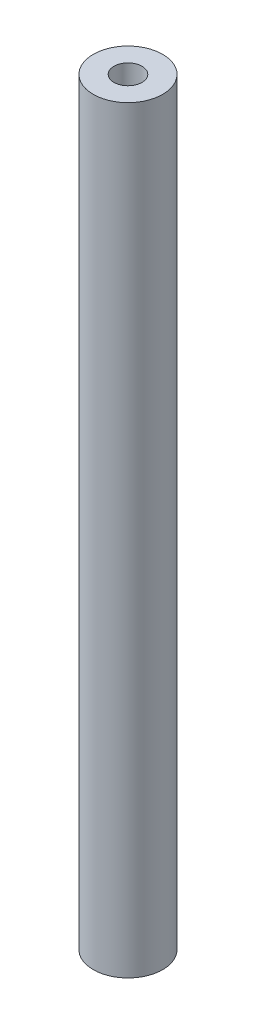
ISO-10303-21;
HEADER;
FILE_DESCRIPTION(('STEP AP214'),'2;1');
FILE_NAME('part.step','',(''),(''),'','','');
FILE_SCHEMA(('AUTOMOTIVE_DESIGN { 1 0 10303 214 1 1 1 1 }'));
ENDSEC;
DATA;
#1=APPLICATION_CONTEXT('core data for automotive mechanical design processes');
#2=APPLICATION_PROTOCOL_DEFINITION('international standard','automotive_design',2000,#1);
#3=PRODUCT_CONTEXT('',#1,'mechanical');
#4=PRODUCT('Part','Part','',(#3));
#5=PRODUCT_RELATED_PRODUCT_CATEGORY('part','',(#4));
#6=PRODUCT_DEFINITION_FORMATION('','',#4);
#7=PRODUCT_DEFINITION_CONTEXT('part definition',#1,'design');
#8=PRODUCT_DEFINITION('design','',#6,#7);
#9=PRODUCT_DEFINITION_SHAPE('','',#8);
#10=(LENGTH_UNIT() NAMED_UNIT(*) SI_UNIT(.MILLI.,.METRE.));
#11=(NAMED_UNIT(*) PLANE_ANGLE_UNIT() SI_UNIT($,.RADIAN.));
#12=(NAMED_UNIT(*) SI_UNIT($,.STERADIAN.) SOLID_ANGLE_UNIT());
#13=UNCERTAINTY_MEASURE_WITH_UNIT(LENGTH_MEASURE(1.E-05),#10,'distance_accuracy_value','');
#14=(GEOMETRIC_REPRESENTATION_CONTEXT(3) GLOBAL_UNCERTAINTY_ASSIGNED_CONTEXT((#13)) GLOBAL_UNIT_ASSIGNED_CONTEXT((#10,
#11,#12)) REPRESENTATION_CONTEXT('',''));
#15=CARTESIAN_POINT('',(0.,0.,0.));
#16=DIRECTION('',(0.,0.,1.));
#17=DIRECTION('',(1.,0.,0.));
#18=AXIS2_PLACEMENT_3D('',#15,#16,#17);
#19=CARTESIAN_POINT('',(0.,-109.22,0.));
#20=DIRECTION('',(0.,1.,0.));
#21=DIRECTION('',(0.,0.,1.));
#22=AXIS2_PLACEMENT_3D('',#19,#20,#21);
#23=CYLINDRICAL_SURFACE('',#22,5.);
#24=CARTESIAN_POINT('',(-2.,-109.22,-4.58257569495584));
#25=CARTESIAN_POINT('',(-2.00000798036347,-109.166194147497,-4.58256464470381));
#26=CARTESIAN_POINT('',(-1.99782891366025,-109.112394334442,-4.58352306077323));
#27=CARTESIAN_POINT('',(-1.98915905973447,-109.005228701745,-4.58729625417543));
#28=CARTESIAN_POINT('',(-1.98266991468793,-108.951862724644,-4.59011032448545));
#29=CARTESIAN_POINT('',(-1.9654760367637,-108.846153178441,-4.59749782920639));
#30=CARTESIAN_POINT('',(-1.95478796820434,-108.793806415956,-4.60206430717533));
#31=CARTESIAN_POINT('',(-1.92931630190661,-108.690299228286,-4.61280053296682));
#32=CARTESIAN_POINT('',(-1.91453245417091,-108.639138875723,-4.61897037865398));
#33=CARTESIAN_POINT('',(-1.86426971793523,-108.488064149418,-4.63959291248421));
#34=CARTESIAN_POINT('',(-1.82284489460008,-108.39034576931,-4.6561744915743));
#35=CARTESIAN_POINT('',(-1.72548191592177,-108.203204419917,-4.6931237076538));
#36=CARTESIAN_POINT('',(-1.66952996336926,-108.113789447038,-4.71349493864007));
#37=CARTESIAN_POINT('',(-1.54131835736855,-107.940737603326,-4.75700999402114));
#38=CARTESIAN_POINT('',(-1.4683691399273,-107.85763278308,-4.78024245635516));
#39=CARTESIAN_POINT('',(-1.3096964617621,-107.704459727789,-4.82612790548655));
#40=CARTESIAN_POINT('',(-1.22397038499683,-107.634394169134,-4.84878077249721));
#41=CARTESIAN_POINT('',(-1.03800590808969,-107.506593605804,-4.89203417106082));
#42=CARTESIAN_POINT('',(-0.937327933050972,-107.449455190738,-4.91251824543531));
#43=CARTESIAN_POINT('',(-0.726824143246722,-107.353155927311,-4.94803944125003));
#44=CARTESIAN_POINT('',(-0.617002169026256,-107.313987575948,-4.96307883544185));
#45=CARTESIAN_POINT('',(-0.396967441295701,-107.256658798689,-4.98538314653816));
#46=CARTESIAN_POINT('',(-0.287031054523069,-107.237573049094,-4.99298922547927));
#47=CARTESIAN_POINT('',(-0.0652684304565223,-107.217971520054,-5.00080310201086));
#48=CARTESIAN_POINT('',(0.0465571232841596,-107.217449161976,-5.0010135205303));
#49=CARTESIAN_POINT('',(0.26223337622678,-107.23448283916,-4.99421960045302));
#50=CARTESIAN_POINT('',(0.366179202506788,-107.251025046674,-4.98761985585461));
#51=CARTESIAN_POINT('',(0.569674786500926,-107.299993427054,-4.96849270441446));
#52=CARTESIAN_POINT('',(0.669224295072839,-107.332420498869,-4.95596496209929));
#53=CARTESIAN_POINT('',(0.862897539070294,-107.412636296424,-4.92596830598785));
#54=CARTESIAN_POINT('',(0.95691685136644,-107.46064924081,-4.90842774755848));
#55=CARTESIAN_POINT('',(1.13580746919776,-107.570464588595,-4.87014602008043));
#56=CARTESIAN_POINT('',(1.22067554984697,-107.632271829691,-4.84940372896448));
#57=CARTESIAN_POINT('',(1.38476339273626,-107.772644180259,-4.80521782746144));
#58=CARTESIAN_POINT('',(1.46324770308939,-107.85204247467,-4.78168627172884));
#59=CARTESIAN_POINT('',(1.60609926099478,-108.022980095148,-4.7356195058465));
#60=CARTESIAN_POINT('',(1.67046007709006,-108.114524922094,-4.71308475332783));
#61=CARTESIAN_POINT('',(1.78493657933605,-108.310470284021,-4.67095688856025));
#62=CARTESIAN_POINT('',(1.83458932217622,-108.41516483666,-4.65146702150583));
#63=CARTESIAN_POINT('',(1.91521298357264,-108.632361524429,-4.61886105059581));
#64=CARTESIAN_POINT('',(1.94621696002208,-108.744849447338,-4.60573367628738));
#65=CARTESIAN_POINT('',(1.9781058182572,-108.918743634158,-4.59208303529493));
#66=CARTESIAN_POINT('',(1.98630505165979,-108.978657549301,-4.58853437680526));
#67=CARTESIAN_POINT('',(1.99725282103812,-109.099035018996,-4.58377540314389));
#68=CARTESIAN_POINT('',(2.00000471568568,-109.159498211758,-4.58256364711745));
#69=CARTESIAN_POINT('',(2.,-109.22,-4.58257569495584));
#70=B_SPLINE_CURVE_WITH_KNOTS('',3,(#24,#25,#26,#27,#28,#29,#30,#31,#32,#33,#34,#35,#36,#37,#38,
#39,#40,#41,#42,#43,#44,#45,#46,#47,#48,#49,#50,#51,#52,#53,#54,#55,#56,#57,#58,#59,#60,#61,#62,
#63,#64,#65,#66,#67,#68,#69),.UNSPECIFIED.,.F.,.F.,(4,2,2,2,2,2,2,2,2,2,2,2,2,2,2,2,2,2,2,2,2,2,
4),(0.,0.161354853098831,0.322648263883215,0.483307911251869,0.643977367092302,
0.964683001739079,1.28569434942626,1.62318047995497,1.9607358053919,2.31162858925762,
2.66237473197322,2.99613876504269,3.32978451514655,3.64468915259535,3.95961161305654,
4.27928176927546,4.59906421133018,4.93981874675152,5.28072813203934,5.63144241548461,
5.98153315592124,6.16300192557813,6.3443587719356),.UNSPECIFIED.);
#71=CARTESIAN_POINT('',(-2.,-109.22,-4.58257569495584));
#72=VERTEX_POINT('',#71);
#73=CARTESIAN_POINT('',(2.,-109.22,-4.58257569495584));
#74=VERTEX_POINT('',#73);
#75=EDGE_CURVE('E145',#72,#74,#70,.T.);
#76=ORIENTED_EDGE('',*,*,#75,.F.);
#77=CARTESIAN_POINT('',(0.,-109.22,0.));
#78=DIRECTION('',(0.,1.,0.));
#79=DIRECTION('',(0.,0.,1.));
#80=AXIS2_PLACEMENT_3D('',#77,#78,#79);
#81=CIRCLE('',#80,5.);
#82=EDGE_CURVE('E196',#72,#74,#81,.T.);
#83=ORIENTED_EDGE('',*,*,#82,.T.);
#84=EDGE_LOOP('',(#76,#83));
#85=FACE_BOUND('',#84,.T.);
#86=CARTESIAN_POINT('',(-1.50000000000002,-68.5,-4.76969600708472));
#87=CARTESIAN_POINT('',(-1.49999897633766,-68.4178054520576,-4.76969685726979));
#88=CARTESIAN_POINT('',(-1.49322108167144,-68.335600775856,-4.77184390209068));
#89=CARTESIAN_POINT('',(-1.46635844446751,-68.173594750408,-4.78016578302899));
#90=CARTESIAN_POINT('',(-1.4462692557358,-68.0937942134985,-4.78634196493467));
#91=CARTESIAN_POINT('',(-1.39352753269957,-67.9389652717282,-4.80196102485632));
#92=CARTESIAN_POINT('',(-1.36089589394245,-67.8639291703669,-4.81139846703232));
#93=CARTESIAN_POINT('',(-1.28406421917931,-67.7203780660047,-4.83246932547567));
#94=CARTESIAN_POINT('',(-1.23986245137054,-67.6518640413155,-4.84410307041019));
#95=CARTESIAN_POINT('',(-1.13964754141628,-67.5211336094226,-4.86866862185765));
#96=CARTESIAN_POINT('',(-1.08333207175808,-67.4591541020537,-4.88162808311635));
#97=CARTESIAN_POINT('',(-0.961136237579611,-67.3453620486775,-4.90714861936757));
#98=CARTESIAN_POINT('',(-0.895254645461126,-67.2935508095501,-4.91970964297705));
#99=CARTESIAN_POINT('',(-0.754111437793702,-67.2005373001667,-4.94333214579389));
#100=CARTESIAN_POINT('',(-0.678684021335823,-67.1595765755572,-4.95435724342404));
#101=CARTESIAN_POINT('',(-0.521624645369358,-67.0910127409572,-4.97334435920684));
#102=CARTESIAN_POINT('',(-0.439994028387916,-67.0634067501425,-4.98130703789495));
#103=CARTESIAN_POINT('',(-0.275323852630832,-67.0231199989095,-4.99307646003589));
#104=CARTESIAN_POINT('',(-0.192391398953802,-67.0100348723473,-4.99699557369338));
#105=CARTESIAN_POINT('',(-0.0254218237493149,-66.9978826753535,-5.00063201501348));
#106=CARTESIAN_POINT('',(0.0586150620503681,-66.998812660598,-5.00035022521079));
#107=CARTESIAN_POINT('',(0.222571156600161,-67.014392868543,-4.99569603817659));
#108=CARTESIAN_POINT('',(0.302536267641344,-67.0286051938098,-4.9914542020526));
#109=CARTESIAN_POINT('',(0.458889213442531,-67.0696313359942,-4.97951522112593));
#110=CARTESIAN_POINT('',(0.53527682132285,-67.0964459509426,-4.97181785750586));
#111=CARTESIAN_POINT('',(0.683347326351286,-67.1622120234185,-4.95365220986963));
#112=CARTESIAN_POINT('',(0.754965064694485,-67.2013012028072,-4.94315269676706));
#113=CARTESIAN_POINT('',(0.890764673783164,-67.2903978524282,-4.92049640648069));
#114=CARTESIAN_POINT('',(0.954944774872138,-67.3404079129635,-4.90833923637778));
#115=CARTESIAN_POINT('',(1.07666048152981,-67.4521977507516,-4.88311550488165));
#116=CARTESIAN_POINT('',(1.13384458040112,-67.5143569190297,-4.87003195321461));
#117=CARTESIAN_POINT('',(1.23707651539824,-67.64751001789,-4.84483979887497));
#118=CARTESIAN_POINT('',(1.28312324482853,-67.7185048253892,-4.83273129317019));
#119=CARTESIAN_POINT('',(1.36313995335452,-67.868239469249,-4.81077903197677));
#120=CARTESIAN_POINT('',(1.39698989237681,-67.9470470458629,-4.80095810695956));
#121=CARTESIAN_POINT('',(1.45083362878414,-68.1096072084455,-4.78496392548436));
#122=CARTESIAN_POINT('',(1.47083194640561,-68.1933581715345,-4.77878947915829));
#123=CARTESIAN_POINT('',(1.49574770282166,-68.3600823607393,-4.77104849541241));
#124=CARTESIAN_POINT('',(1.50119946380212,-68.442968223894,-4.7693187867044));
#125=CARTESIAN_POINT('',(1.49835947233063,-68.6084729000098,-4.77021192441924));
#126=CARTESIAN_POINT('',(1.4900696437133,-68.6910917487308,-4.77283416156589));
#127=CARTESIAN_POINT('',(1.4604576357419,-68.8514883779709,-4.78197558554912));
#128=CARTESIAN_POINT('',(1.4394796143128,-68.9293361642635,-4.78839176507489));
#129=CARTESIAN_POINT('',(1.3854857774794,-69.0804016908149,-4.80429141231227));
#130=CARTESIAN_POINT('',(1.3524681034276,-69.1536187141406,-4.81377535359073));
#131=CARTESIAN_POINT('',(1.274318711965,-69.2955174640721,-4.83505835023047));
#132=CARTESIAN_POINT('',(1.22888564172729,-69.3640247209858,-4.84691271069799));
#133=CARTESIAN_POINT('',(1.12755301600384,-69.4926381061808,-4.87148205646987));
#134=CARTESIAN_POINT('',(1.07165095534896,-69.5527422176128,-4.88419724730003));
#135=CARTESIAN_POINT('',(0.948455132493588,-69.6651804058147,-4.90963633548158));
#136=CARTESIAN_POINT('',(0.880811065857424,-69.717135628987,-4.92234245063004));
#137=CARTESIAN_POINT('',(0.737461784590238,-69.8089667010278,-4.94584851748651));
#138=CARTESIAN_POINT('',(0.661756970543932,-69.8488431497815,-4.95664856384717));
#139=CARTESIAN_POINT('',(0.504935504705207,-69.9150000305683,-4.97505970474957));
#140=CARTESIAN_POINT('',(0.423864622037823,-69.941382016159,-4.98269453424966));
#141=CARTESIAN_POINT('',(0.258169966504572,-69.9800609188904,-4.99401979596827));
#142=CARTESIAN_POINT('',(0.173547217354746,-69.9923618659484,-4.9977113567088));
#143=CARTESIAN_POINT('',(0.00665215388272635,-70.0022230440545,-5.00066544081399));
#144=CARTESIAN_POINT('',(-0.0755851790862232,-70.0003326954078,-5.00009305111322));
#145=CARTESIAN_POINT('',(-0.23851948116442,-69.9831783675009,-4.99497264465037));
#146=CARTESIAN_POINT('',(-0.319216537346544,-69.9679151465195,-4.99042485330462));
#147=CARTESIAN_POINT('',(-0.475935813041377,-69.9247883386004,-4.97791168358326));
#148=CARTESIAN_POINT('',(-0.551998927351414,-69.897061819351,-4.96998352900865));
#149=CARTESIAN_POINT('',(-0.698433237752075,-69.8299180854928,-4.9515294303945));
#150=CARTESIAN_POINT('',(-0.768803496050599,-69.7904989497138,-4.94100305949946));
#151=CARTESIAN_POINT('',(-0.904301892420584,-69.6996265425699,-4.91803965828228));
#152=CARTESIAN_POINT('',(-0.969190250076792,-69.6478285699992,-4.90555226923559));
#153=CARTESIAN_POINT('',(-1.08953757134597,-69.5342896116672,-4.88023537212333));
#154=CARTESIAN_POINT('',(-1.14499380960196,-69.4725457621018,-4.86740576641079));
#155=CARTESIAN_POINT('',(-1.2465626939455,-69.3386592216895,-4.84240680631319));
#156=CARTESIAN_POINT('',(-1.29234759757958,-69.2662614466095,-4.83026852693485));
#157=CARTESIAN_POINT('',(-1.37104313528777,-69.114444825839,-4.80852547508792));
#158=CARTESIAN_POINT('',(-1.40395995557291,-69.0350293763988,-4.79891948596955));
#159=CARTESIAN_POINT('',(-1.45301942532952,-68.8802595683937,-4.78427816717594));
#160=CARTESIAN_POINT('',(-1.47058859011234,-68.805391353069,-4.77886154840519));
#161=CARTESIAN_POINT('',(-1.49407818835146,-68.6536847775042,-4.77157042597166));
#162=CARTESIAN_POINT('',(-1.50000095706097,-68.5768468153547,-4.7696952122143));
#163=CARTESIAN_POINT('',(-1.50000000000002,-68.5,-4.76969600708472));
#164=B_SPLINE_CURVE_WITH_KNOTS('',3,(#86,#87,#88,#89,#90,#91,#92,#93,#94,#95,#96,#97,#98,#99,
#100,#101,#102,#103,#104,#105,#106,#107,#108,#109,#110,#111,#112,#113,#114,#115,#116,#117,#118,
#119,#120,#121,#122,#123,#124,#125,#126,#127,#128,#129,#130,#131,#132,#133,#134,#135,#136,#137,
#138,#139,#140,#141,#142,#143,#144,#145,#146,#147,#148,#149,#150,#151,#152,#153,#154,#155,#156,
#157,#158,#159,#160,#161,#162,#163),.UNSPECIFIED.,.T.,.F.,(4,2,2,2,2,2,2,2,2,2,2,2,2,2,2,2,2,2,
2,2,2,2,2,2,2,2,2,2,2,2,2,2,2,2,2,2,2,2,4),(0.,0.246300165915535,0.492682641689008,
0.738656414466206,0.984667025370114,1.23773150007985,1.49082847871274,1.74915939273647,
2.00743455587879,2.2583214014956,2.50915554101443,2.75200125990883,2.99486235890379,
3.2405520933568,3.48630016590834,3.74152147023282,3.99676812491867,4.25446238246274,
4.51207250628416,4.76008080790314,5.00805439107393,5.24958594938823,5.49115481045793,
5.73920731809394,5.98731925928929,6.24479506100608,6.50225807324208,6.75775391814331,
7.01317662321689,7.25876303911227,7.50433553047761,7.74727096872226,7.99024634491386,
8.24099627054496,8.49181852629898,8.75011639669154,9.00828993963952,9.23861153857455,
9.46888695033568),.UNSPECIFIED.);
#165=CARTESIAN_POINT('',(1.50000000000001,-68.5,-4.76969600708473));
#166=VERTEX_POINT('',#165);
#167=CARTESIAN_POINT('',(-1.50000000000002,-68.5,-4.76969600708472));
#168=VERTEX_POINT('',#167);
#169=EDGE_CURVE('E227',#166,#168,#164,.T.);
#170=ORIENTED_EDGE('',*,*,#169,.F.);
#171=DIRECTION('',(0.,1.,0.));
#172=VECTOR('',#171,1.);
#173=CARTESIAN_POINT('',(1.5,-109.22,-4.76969600708473));
#174=LINE('',#173,#172);
#175=CARTESIAN_POINT('',(1.50000000000001,-63.5,-4.76969600708473));
#176=VERTEX_POINT('',#175);
#177=EDGE_CURVE('E11',#176,#166,#174,.F.);
#178=ORIENTED_EDGE('',*,*,#177,.F.);
#179=CARTESIAN_POINT('',(-1.50000000000002,-63.5,-4.76969600708472));
#180=CARTESIAN_POINT('',(-1.49999897633766,-63.4178054520576,-4.76969685726979));
#181=CARTESIAN_POINT('',(-1.49322108167144,-63.335600775856,-4.77184390209068));
#182=CARTESIAN_POINT('',(-1.46635844446751,-63.1735947504081,-4.78016578302899));
#183=CARTESIAN_POINT('',(-1.4462692557358,-63.0937942134985,-4.78634196493467));
#184=CARTESIAN_POINT('',(-1.39352753269957,-62.9389652717283,-4.80196102485632));
#185=CARTESIAN_POINT('',(-1.36089589394245,-62.8639291703669,-4.81139846703232));
#186=CARTESIAN_POINT('',(-1.28406421917931,-62.7203780660047,-4.83246932547567));
#187=CARTESIAN_POINT('',(-1.23986245137054,-62.6518640413155,-4.84410307041019));
#188=CARTESIAN_POINT('',(-1.13964754141628,-62.5211336094226,-4.86866862185765));
#189=CARTESIAN_POINT('',(-1.08333207175808,-62.4591541020537,-4.88162808311635));
#190=CARTESIAN_POINT('',(-0.961136237579609,-62.3453620486775,-4.90714861936757));
#191=CARTESIAN_POINT('',(-0.895254645461121,-62.2935508095501,-4.91970964297705));
#192=CARTESIAN_POINT('',(-0.754111437793697,-62.2005373001667,-4.94333214579389));
#193=CARTESIAN_POINT('',(-0.67868402133582,-62.1595765755572,-4.95435724342404));
#194=CARTESIAN_POINT('',(-0.521624645369357,-62.0910127409572,-4.97334435920684));
#195=CARTESIAN_POINT('',(-0.439994028387913,-62.0634067501425,-4.98130703789495));
#196=CARTESIAN_POINT('',(-0.27532385263083,-62.0231199989095,-4.99307646003589));
#197=CARTESIAN_POINT('',(-0.192391398953801,-62.0100348723473,-4.99699557369338));
#198=CARTESIAN_POINT('',(-0.0254218237493146,-61.9978826753536,-5.00063201501348));
#199=CARTESIAN_POINT('',(0.0586150620503687,-61.998812660598,-5.00035022521079));
#200=CARTESIAN_POINT('',(0.222571156600162,-62.014392868543,-4.99569603817658));
#201=CARTESIAN_POINT('',(0.302536267641344,-62.0286051938099,-4.9914542020526));
#202=CARTESIAN_POINT('',(0.45888921344253,-62.0696313359943,-4.97951522112593));
#203=CARTESIAN_POINT('',(0.535276821322849,-62.0964459509427,-4.97181785750586));
#204=CARTESIAN_POINT('',(0.683347326351285,-62.1622120234186,-4.95365220986963));
#205=CARTESIAN_POINT('',(0.754965064694483,-62.2013012028073,-4.94315269676706));
#206=CARTESIAN_POINT('',(0.890764673783162,-62.2903978524282,-4.92049640648069));
#207=CARTESIAN_POINT('',(0.954944774872136,-62.3404079129635,-4.90833923637778));
#208=CARTESIAN_POINT('',(1.0766604815298,-62.4521977507516,-4.88311550488165));
#209=CARTESIAN_POINT('',(1.13384458040112,-62.5143569190297,-4.87003195321461));
#210=CARTESIAN_POINT('',(1.23707651539824,-62.6475100178901,-4.84483979887497));
#211=CARTESIAN_POINT('',(1.28312324482853,-62.7185048253892,-4.83273129317019));
#212=CARTESIAN_POINT('',(1.36313995335451,-62.868239469249,-4.81077903197677));
#213=CARTESIAN_POINT('',(1.3969898923768,-62.9470470458629,-4.80095810695956));
#214=CARTESIAN_POINT('',(1.45083362878414,-63.1096072084456,-4.78496392548436));
#215=CARTESIAN_POINT('',(1.47083194640561,-63.1933581715346,-4.77878947915829));
#216=CARTESIAN_POINT('',(1.49574770282166,-63.3600823607393,-4.77104849541241));
#217=CARTESIAN_POINT('',(1.50119946380213,-63.442968223894,-4.7693187867044));
#218=CARTESIAN_POINT('',(1.49835947233063,-63.6084729000099,-4.77021192441924));
#219=CARTESIAN_POINT('',(1.4900696437133,-63.6910917487309,-4.77283416156589));
#220=CARTESIAN_POINT('',(1.4604576357419,-63.8514883779709,-4.78197558554912));
#221=CARTESIAN_POINT('',(1.4394796143128,-63.9293361642636,-4.78839176507489));
#222=CARTESIAN_POINT('',(1.3854857774794,-64.0804016908149,-4.80429141231227));
#223=CARTESIAN_POINT('',(1.3524681034276,-64.1536187141406,-4.81377535359073));
#224=CARTESIAN_POINT('',(1.274318711965,-64.2955174640721,-4.83505835023047));
#225=CARTESIAN_POINT('',(1.22888564172728,-64.3640247209858,-4.84691271069799));
#226=CARTESIAN_POINT('',(1.12755301600384,-64.4926381061808,-4.87148205646987));
#227=CARTESIAN_POINT('',(1.07165095534896,-64.5527422176128,-4.88419724730003));
#228=CARTESIAN_POINT('',(0.94845513249359,-64.6651804058148,-4.90963633548158));
#229=CARTESIAN_POINT('',(0.880811065857425,-64.717135628987,-4.92234245063004));
#230=CARTESIAN_POINT('',(0.737461784590238,-64.8089667010278,-4.94584851748651));
#231=CARTESIAN_POINT('',(0.661756970543932,-64.8488431497815,-4.95664856384717));
#232=CARTESIAN_POINT('',(0.504935504705207,-64.9150000305683,-4.97505970474957));
#233=CARTESIAN_POINT('',(0.423864622037824,-64.941382016159,-4.98269453424966));
#234=CARTESIAN_POINT('',(0.258169966504572,-64.9800609188904,-4.99401979596827));
#235=CARTESIAN_POINT('',(0.173547217354746,-64.9923618659484,-4.9977113567088));
#236=CARTESIAN_POINT('',(0.00665215388272632,-65.0022230440545,-5.00066544081399));
#237=CARTESIAN_POINT('',(-0.0755851790862232,-65.0003326954078,-5.00009305111322));
#238=CARTESIAN_POINT('',(-0.23851948116442,-64.9831783675009,-4.99497264465037));
#239=CARTESIAN_POINT('',(-0.319216537346545,-64.9679151465196,-4.99042485330462));
#240=CARTESIAN_POINT('',(-0.475935813041377,-64.9247883386004,-4.97791168358326));
#241=CARTESIAN_POINT('',(-0.551998927351414,-64.897061819351,-4.96998352900865));
#242=CARTESIAN_POINT('',(-0.698433237752075,-64.8299180854928,-4.9515294303945));
#243=CARTESIAN_POINT('',(-0.768803496050599,-64.7904989497138,-4.94100305949946));
#244=CARTESIAN_POINT('',(-0.904301892420584,-64.69962654257,-4.91803965828228));
#245=CARTESIAN_POINT('',(-0.969190250076792,-64.6478285699992,-4.90555226923559));
#246=CARTESIAN_POINT('',(-1.08953757134597,-64.5342896116672,-4.88023537212333));
#247=CARTESIAN_POINT('',(-1.14499380960196,-64.4725457621018,-4.86740576641079));
#248=CARTESIAN_POINT('',(-1.2465626939455,-64.3386592216895,-4.84240680631319));
#249=CARTESIAN_POINT('',(-1.29234759757958,-64.2662614466096,-4.83026852693485));
#250=CARTESIAN_POINT('',(-1.37104313528777,-64.114444825839,-4.80852547508792));
#251=CARTESIAN_POINT('',(-1.40395995557291,-64.0350293763988,-4.79891948596955));
#252=CARTESIAN_POINT('',(-1.45301942532952,-63.8802595683937,-4.78427816717594));
#253=CARTESIAN_POINT('',(-1.47058859011234,-63.805391353069,-4.77886154840519));
#254=CARTESIAN_POINT('',(-1.49407818835146,-63.6536847775042,-4.77157042597166));
#255=CARTESIAN_POINT('',(-1.50000095706097,-63.5768468153547,-4.7696952122143));
#256=CARTESIAN_POINT('',(-1.50000000000002,-63.5,-4.76969600708472));
#257=B_SPLINE_CURVE_WITH_KNOTS('',3,(#179,#180,#181,#182,#183,#184,#185,#186,#187,#188,#189,
#190,#191,#192,#193,#194,#195,#196,#197,#198,#199,#200,#201,#202,#203,#204,#205,#206,#207,#208,
#209,#210,#211,#212,#213,#214,#215,#216,#217,#218,#219,#220,#221,#222,#223,#224,#225,#226,#227,
#228,#229,#230,#231,#232,#233,#234,#235,#236,#237,#238,#239,#240,#241,#242,#243,#244,#245,#246,
#247,#248,#249,#250,#251,#252,#253,#254,#255,#256),.UNSPECIFIED.,.T.,.F.,(4,2,2,2,2,2,2,2,2,2,2,
2,2,2,2,2,2,2,2,2,2,2,2,2,2,2,2,2,2,2,2,2,2,2,2,2,2,2,4),(0.,0.246300165915535,
0.492682641689008,0.738656414466206,0.984667025370114,1.23773150007985,1.49082847871275,
1.74915939273647,2.0074345558788,2.25832140149561,2.50915554101443,2.75200125990883,
2.99486235890379,3.24055209335679,3.48630016590834,3.74152147023282,3.99676812491867,
4.25446238246271,4.51207250628416,4.76008080790315,5.00805439107393,5.24958594938823,
5.49115481045793,5.73920731809395,5.98731925928929,6.24479506100608,6.50225807324209,
6.75775391814331,7.01317662321689,7.25876303911227,7.50433553047761,7.74727096872226,
7.99024634491386,8.24099627054496,8.49181852629898,8.75011639669154,9.00828993963953,
9.23861153857455,9.46888695033568),.UNSPECIFIED.);
#258=CARTESIAN_POINT('',(-1.50000000000002,-63.5,-4.76969600708472));
#259=VERTEX_POINT('',#258);
#260=EDGE_CURVE('E45',#259,#176,#257,.T.);
#261=ORIENTED_EDGE('',*,*,#260,.F.);
#262=DIRECTION('',(0.,1.,0.));
#263=VECTOR('',#262,1.);
#264=CARTESIAN_POINT('',(-1.50000000000003,-109.22,-4.76969600708472));
#265=LINE('',#264,#263);
#266=EDGE_CURVE('E224',#259,#168,#265,.F.);
#267=ORIENTED_EDGE('',*,*,#266,.T.);
#268=EDGE_LOOP('',(#170,#178,#261,#267));
#269=FACE_BOUND('',#268,.T.);
#270=CARTESIAN_POINT('',(-1.5,-15.39,-4.76969600708473));
#271=CARTESIAN_POINT('',(-1.49999897633764,-15.3078054520576,-4.7696968572698));
#272=CARTESIAN_POINT('',(-1.49322108167142,-15.225600775856,-4.77184390209069));
#273=CARTESIAN_POINT('',(-1.46635844446749,-15.063594750408,-4.780165783029));
#274=CARTESIAN_POINT('',(-1.44626925573578,-14.9837942134985,-4.78634196493468));
#275=CARTESIAN_POINT('',(-1.39352753269955,-14.8289652717283,-4.80196102485632));
#276=CARTESIAN_POINT('',(-1.36089589394243,-14.7539291703669,-4.81139846703232));
#277=CARTESIAN_POINT('',(-1.28406421917929,-14.6103780660047,-4.83246932547567));
#278=CARTESIAN_POINT('',(-1.23986245137053,-14.5418640413156,-4.84410307041019));
#279=CARTESIAN_POINT('',(-1.13964754141627,-14.4111336094226,-4.86866862185765));
#280=CARTESIAN_POINT('',(-1.08333207175807,-14.3491541020537,-4.88162808311636));
#281=CARTESIAN_POINT('',(-0.9611362375796,-14.2353620486775,-4.90714861936757));
#282=CARTESIAN_POINT('',(-0.895254645461113,-14.1835508095501,-4.91970964297705));
#283=CARTESIAN_POINT('',(-0.754111437793691,-14.0905373001667,-4.94333214579389));
#284=CARTESIAN_POINT('',(-0.678684021335816,-14.0495765755572,-4.95435724342404));
#285=CARTESIAN_POINT('',(-0.521624645369355,-13.9810127409572,-4.97334435920684));
#286=CARTESIAN_POINT('',(-0.439994028387913,-13.9534067501425,-4.98130703789495));
#287=CARTESIAN_POINT('',(-0.27532385263083,-13.9131199989095,-4.99307646003589));
#288=CARTESIAN_POINT('',(-0.192391398953802,-13.9000348723473,-4.99699557369338));
#289=CARTESIAN_POINT('',(-0.0254218237493163,-13.8878826753536,-5.00063201501348));
#290=CARTESIAN_POINT('',(0.0586150620503669,-13.888812660598,-5.00035022521079));
#291=CARTESIAN_POINT('',(0.222571156600159,-13.904392868543,-4.99569603817659));
#292=CARTESIAN_POINT('',(0.30253626764134,-13.9186051938099,-4.9914542020526));
#293=CARTESIAN_POINT('',(0.458889213442525,-13.9596313359943,-4.97951522112593));
#294=CARTESIAN_POINT('',(0.535276821322844,-13.9864459509427,-4.97181785750586));
#295=CARTESIAN_POINT('',(0.683347326351279,-14.0522120234185,-4.95365220986963));
#296=CARTESIAN_POINT('',(0.754965064694476,-14.0913012028073,-4.94315269676706));
#297=CARTESIAN_POINT('',(0.890764673783154,-14.1803978524282,-4.92049640648069));
#298=CARTESIAN_POINT('',(0.954944774872129,-14.2304079129635,-4.90833923637778));
#299=CARTESIAN_POINT('',(1.0766604815298,-14.3421977507516,-4.88311550488165));
#300=CARTESIAN_POINT('',(1.13384458040111,-14.4043569190297,-4.87003195321461));
#301=CARTESIAN_POINT('',(1.23707651539823,-14.53751001789,-4.84483979887497));
#302=CARTESIAN_POINT('',(1.28312324482852,-14.6085048253892,-4.8327312931702));
#303=CARTESIAN_POINT('',(1.3631399533545,-14.758239469249,-4.81077903197678));
#304=CARTESIAN_POINT('',(1.39698989237679,-14.8370470458629,-4.80095810695957));
#305=CARTESIAN_POINT('',(1.45083362878413,-14.9996072084455,-4.78496392548436));
#306=CARTESIAN_POINT('',(1.4708319464056,-15.0833581715345,-4.7787894791583));
#307=CARTESIAN_POINT('',(1.49574770282165,-15.2500823607393,-4.77104849541241));
#308=CARTESIAN_POINT('',(1.50119946380212,-15.332968223894,-4.76931878670441));
#309=CARTESIAN_POINT('',(1.49835947233062,-15.4984729000099,-4.77021192441924));
#310=CARTESIAN_POINT('',(1.4900696437133,-15.5810917487308,-4.77283416156589));
#311=CARTESIAN_POINT('',(1.4604576357419,-15.7414883779709,-4.78197558554912));
#312=CARTESIAN_POINT('',(1.4394796143128,-15.8193361642635,-4.78839176507489));
#313=CARTESIAN_POINT('',(1.3854857774794,-15.9704016908149,-4.80429141231227));
#314=CARTESIAN_POINT('',(1.3524681034276,-16.0436187141406,-4.81377535359073));
#315=CARTESIAN_POINT('',(1.274318711965,-16.1855174640721,-4.83505835023047));
#316=CARTESIAN_POINT('',(1.22888564172729,-16.2540247209858,-4.84691271069799));
#317=CARTESIAN_POINT('',(1.12755301600385,-16.3826381061808,-4.87148205646987));
#318=CARTESIAN_POINT('',(1.07165095534897,-16.4427422176128,-4.88419724730003));
#319=CARTESIAN_POINT('',(0.948455132493601,-16.5551804058147,-4.90963633548158));
#320=CARTESIAN_POINT('',(0.880811065857437,-16.607135628987,-4.92234245063004));
#321=CARTESIAN_POINT('',(0.737461784590251,-16.6989667010277,-4.94584851748651));
#322=CARTESIAN_POINT('',(0.661756970543946,-16.7388431497815,-4.95664856384717));
#323=CARTESIAN_POINT('',(0.504935504705224,-16.8050000305683,-4.97505970474957));
#324=CARTESIAN_POINT('',(0.423864622037842,-16.831382016159,-4.98269453424965));
#325=CARTESIAN_POINT('',(0.258169966504592,-16.8700609188904,-4.99401979596827));
#326=CARTESIAN_POINT('',(0.173547217354766,-16.8823618659484,-4.9977113567088));
#327=CARTESIAN_POINT('',(0.00665215388274591,-16.8922230440545,-5.00066544081399));
#328=CARTESIAN_POINT('',(-0.0755851790862039,-16.8903326954078,-5.00009305111322));
#329=CARTESIAN_POINT('',(-0.238519481164402,-16.8731783675009,-4.99497264465037));
#330=CARTESIAN_POINT('',(-0.319216537346527,-16.8579151465196,-4.99042485330463));
#331=CARTESIAN_POINT('',(-0.475935813041356,-16.8147883386004,-4.97791168358327));
#332=CARTESIAN_POINT('',(-0.55199892735139,-16.787061819351,-4.96998352900866));
#333=CARTESIAN_POINT('',(-0.698433237752051,-16.7199180854928,-4.9515294303945));
#334=CARTESIAN_POINT('',(-0.768803496050578,-16.6804989497138,-4.94100305949946));
#335=CARTESIAN_POINT('',(-0.904301892420561,-16.58962654257,-4.91803965828228));
#336=CARTESIAN_POINT('',(-0.969190250076765,-16.5378285699992,-4.90555226923559));
#337=CARTESIAN_POINT('',(-1.08953757134594,-16.4242896116672,-4.88023537212334));
#338=CARTESIAN_POINT('',(-1.14499380960193,-16.3625457621018,-4.86740576641079));
#339=CARTESIAN_POINT('',(-1.24656269394548,-16.2286592216895,-4.84240680631319));
#340=CARTESIAN_POINT('',(-1.29234759757956,-16.1562614466096,-4.83026852693485));
#341=CARTESIAN_POINT('',(-1.37104313528776,-16.004444825839,-4.80852547508793));
#342=CARTESIAN_POINT('',(-1.40395995557288,-15.9250293763988,-4.79891948596956));
#343=CARTESIAN_POINT('',(-1.45301942532949,-15.7702595683937,-4.78427816717594));
#344=CARTESIAN_POINT('',(-1.47058859011231,-15.695391353069,-4.7788615484052));
#345=CARTESIAN_POINT('',(-1.49407818835144,-15.5436847775042,-4.77157042597167));
#346=CARTESIAN_POINT('',(-1.50000095706095,-15.4668468153547,-4.7696952122143));
#347=CARTESIAN_POINT('',(-1.5,-15.39,-4.76969600708473));
#348=B_SPLINE_CURVE_WITH_KNOTS('',3,(#270,#271,#272,#273,#274,#275,#276,#277,#278,#279,#280,
#281,#282,#283,#284,#285,#286,#287,#288,#289,#290,#291,#292,#293,#294,#295,#296,#297,#298,#299,
#300,#301,#302,#303,#304,#305,#306,#307,#308,#309,#310,#311,#312,#313,#314,#315,#316,#317,#318,
#319,#320,#321,#322,#323,#324,#325,#326,#327,#328,#329,#330,#331,#332,#333,#334,#335,#336,#337,
#338,#339,#340,#341,#342,#343,#344,#345,#346,#347),.UNSPECIFIED.,.T.,.F.,(4,2,2,2,2,2,2,2,2,2,2,
2,2,2,2,2,2,2,2,2,2,2,2,2,2,2,2,2,2,2,2,2,2,2,2,2,2,2,4),(0.,0.246300165915544,
0.492682641688999,0.738656414466193,0.9846670253701,1.23773150007984,1.49082847871273,
1.74915939273644,2.00743455587877,2.25832140149558,2.5091555410144,2.7520012599088,
2.99486235890376,3.24055209335676,3.4863001659083,3.74152147023278,3.99676812491863,
4.25446238246266,4.51207250628411,4.76008080790309,5.00805439107387,5.24958594938817,
5.49115481045787,5.73920731809388,5.98731925928922,6.24479506100602,6.50225807324202,
6.75775391814324,7.01317662321682,7.2587630391122,7.50433553047754,7.74727096872219,
7.99024634491378,8.24099627054488,8.4918185262989,8.75011639669147,9.00828993963944,
9.23861153857447,9.4688869503356),.UNSPECIFIED.);
#349=CARTESIAN_POINT('',(1.5,-15.39,-4.76969600708473));
#350=VERTEX_POINT('',#349);
#351=CARTESIAN_POINT('',(-1.5,-15.39,-4.76969600708473));
#352=VERTEX_POINT('',#351);
#353=EDGE_CURVE('E261',#350,#352,#348,.T.);
#354=ORIENTED_EDGE('',*,*,#353,.F.);
#355=DIRECTION('',(0.,1.,0.));
#356=VECTOR('',#355,1.);
#357=CARTESIAN_POINT('',(1.49999999999999,-109.22,-4.76969600708473));
#358=LINE('',#357,#356);
#359=CARTESIAN_POINT('',(1.5,-10.39,-4.76969600708473));
#360=VERTEX_POINT('',#359);
#361=EDGE_CURVE('E232',#360,#350,#358,.F.);
#362=ORIENTED_EDGE('',*,*,#361,.F.);
#363=CARTESIAN_POINT('',(-1.49999999999999,-10.39,-4.76969600708473));
#364=CARTESIAN_POINT('',(-1.49999897633763,-10.3078054520576,-4.7696968572698));
#365=CARTESIAN_POINT('',(-1.49322108167141,-10.225600775856,-4.77184390209069));
#366=CARTESIAN_POINT('',(-1.46635844446748,-10.0635947504081,-4.780165783029));
#367=CARTESIAN_POINT('',(-1.44626925573577,-9.98379421349855,-4.78634196493468));
#368=CARTESIAN_POINT('',(-1.39352753269954,-9.82896527172828,-4.80196102485633));
#369=CARTESIAN_POINT('',(-1.36089589394242,-9.75392917036693,-4.81139846703232));
#370=CARTESIAN_POINT('',(-1.28406421917928,-9.61037806600471,-4.83246932547567));
#371=CARTESIAN_POINT('',(-1.23986245137051,-9.54186404131558,-4.8441030704102));
#372=CARTESIAN_POINT('',(-1.13964754141626,-9.41113360942264,-4.86866862185766));
#373=CARTESIAN_POINT('',(-1.08333207175806,-9.34915410205372,-4.88162808311636));
#374=CARTESIAN_POINT('',(-0.961136237579587,-9.2353620486775,-4.90714861936757));
#375=CARTESIAN_POINT('',(-0.8952546454611,-9.18355080955013,-4.91970964297705));
#376=CARTESIAN_POINT('',(-0.754111437793678,-9.09053730016671,-4.94333214579389));
#377=CARTESIAN_POINT('',(-0.678684021335803,-9.0495765755572,-4.95435724342404));
#378=CARTESIAN_POINT('',(-0.521624645369342,-8.98101274095726,-4.97334435920684));
#379=CARTESIAN_POINT('',(-0.4399940283879,-8.95340675014256,-4.98130703789495));
#380=CARTESIAN_POINT('',(-0.275323852630817,-8.9131199989095,-4.99307646003589));
#381=CARTESIAN_POINT('',(-0.192391398953789,-8.90003487234731,-4.99699557369338));
#382=CARTESIAN_POINT('',(-0.0254218237493032,-8.88788267535357,-5.00063201501348));
#383=CARTESIAN_POINT('',(0.0586150620503801,-8.88881266059805,-5.00035022521079));
#384=CARTESIAN_POINT('',(0.222571156600172,-8.90439286854304,-4.99569603817658));
#385=CARTESIAN_POINT('',(0.302536267641353,-8.91860519380988,-4.9914542020526));
#386=CARTESIAN_POINT('',(0.458889213442538,-8.9596313359943,-4.97951522112593));
#387=CARTESIAN_POINT('',(0.535276821322857,-8.98644595094268,-4.97181785750586));
#388=CARTESIAN_POINT('',(0.683347326351292,-9.05221202341857,-4.95365220986963));
#389=CARTESIAN_POINT('',(0.754965064694489,-9.09130120280728,-4.94315269676706));
#390=CARTESIAN_POINT('',(0.890764673783167,-9.18039785242824,-4.92049640648069));
#391=CARTESIAN_POINT('',(0.954944774872142,-9.2304079129635,-4.90833923637778));
#392=CARTESIAN_POINT('',(1.07666048152981,-9.34219775075161,-4.88311550488165));
#393=CARTESIAN_POINT('',(1.13384458040113,-9.40435691902975,-4.87003195321461));
#394=CARTESIAN_POINT('',(1.23707651539825,-9.53751001789006,-4.84483979887497));
#395=CARTESIAN_POINT('',(1.28312324482854,-9.60850482538924,-4.83273129317019));
#396=CARTESIAN_POINT('',(1.36313995335451,-9.758239469249,-4.81077903197677));
#397=CARTESIAN_POINT('',(1.39698989237681,-9.83704704586293,-4.80095810695956));
#398=CARTESIAN_POINT('',(1.45083362878415,-9.99960720844556,-4.78496392548436));
#399=CARTESIAN_POINT('',(1.47083194640561,-10.0833581715346,-4.77878947915829));
#400=CARTESIAN_POINT('',(1.49574770282166,-10.2500823607393,-4.77104849541241));
#401=CARTESIAN_POINT('',(1.50119946380213,-10.332968223894,-4.7693187867044));
#402=CARTESIAN_POINT('',(1.49835947233063,-10.4984729000099,-4.77021192441923));
#403=CARTESIAN_POINT('',(1.49006964371331,-10.5810917487309,-4.77283416156589));
#404=CARTESIAN_POINT('',(1.46045763574191,-10.7414883779709,-4.78197558554912));
#405=CARTESIAN_POINT('',(1.43947961431281,-10.8193361642635,-4.78839176507488));
#406=CARTESIAN_POINT('',(1.38548577747941,-10.9704016908149,-4.80429141231227));
#407=CARTESIAN_POINT('',(1.35246810342761,-11.0436187141406,-4.81377535359073));
#408=CARTESIAN_POINT('',(1.27431871196502,-11.1855174640721,-4.83505835023047));
#409=CARTESIAN_POINT('',(1.2288856417273,-11.2540247209858,-4.84691271069798));
#410=CARTESIAN_POINT('',(1.12755301600386,-11.3826381061808,-4.87148205646987));
#411=CARTESIAN_POINT('',(1.07165095534898,-11.4427422176128,-4.88419724730003));
#412=CARTESIAN_POINT('',(0.948455132493612,-11.5551804058147,-4.90963633548158));
#413=CARTESIAN_POINT('',(0.880811065857447,-11.607135628987,-4.92234245063004));
#414=CARTESIAN_POINT('',(0.737461784590263,-11.6989667010278,-4.9458485174865));
#415=CARTESIAN_POINT('',(0.661756970543958,-11.7388431497815,-4.95664856384717));
#416=CARTESIAN_POINT('',(0.504935504705236,-11.8050000305683,-4.97505970474957));
#417=CARTESIAN_POINT('',(0.423864622037853,-11.831382016159,-4.98269453424965));
#418=CARTESIAN_POINT('',(0.258169966504602,-11.8700609188904,-4.99401979596827));
#419=CARTESIAN_POINT('',(0.173547217354777,-11.8823618659484,-4.9977113567088));
#420=CARTESIAN_POINT('',(0.00665215388275694,-11.8922230440545,-5.00066544081399));
#421=CARTESIAN_POINT('',(-0.0755851790861925,-11.8903326954078,-5.00009305111322));
#422=CARTESIAN_POINT('',(-0.23851948116439,-11.8731783675009,-4.99497264465037));
#423=CARTESIAN_POINT('',(-0.319216537346515,-11.8579151465196,-4.99042485330463));
#424=CARTESIAN_POINT('',(-0.475935813041345,-11.8147883386004,-4.97791168358327));
#425=CARTESIAN_POINT('',(-0.551998927351378,-11.787061819351,-4.96998352900866));
#426=CARTESIAN_POINT('',(-0.698433237752039,-11.7199180854928,-4.9515294303945));
#427=CARTESIAN_POINT('',(-0.768803496050566,-11.6804989497138,-4.94100305949946));
#428=CARTESIAN_POINT('',(-0.904301892420549,-11.58962654257,-4.91803965828228));
#429=CARTESIAN_POINT('',(-0.969190250076752,-11.5378285699992,-4.90555226923559));
#430=CARTESIAN_POINT('',(-1.08953757134593,-11.4242896116672,-4.88023537212334));
#431=CARTESIAN_POINT('',(-1.14499380960192,-11.3625457621019,-4.86740576641079));
#432=CARTESIAN_POINT('',(-1.24656269394547,-11.2286592216895,-4.84240680631319));
#433=CARTESIAN_POINT('',(-1.29234759757955,-11.1562614466096,-4.83026852693486));
#434=CARTESIAN_POINT('',(-1.37104313528774,-11.004444825839,-4.80852547508793));
#435=CARTESIAN_POINT('',(-1.40395995557287,-10.9250293763988,-4.79891948596956));
#436=CARTESIAN_POINT('',(-1.45301942532948,-10.7702595683937,-4.78427816717595));
#437=CARTESIAN_POINT('',(-1.4705885901123,-10.695391353069,-4.7788615484052));
#438=CARTESIAN_POINT('',(-1.49407818835143,-10.5436847775042,-4.77157042597167));
#439=CARTESIAN_POINT('',(-1.50000095706094,-10.4668468153548,-4.76969521221431));
#440=CARTESIAN_POINT('',(-1.49999999999999,-10.39,-4.76969600708473));
#441=B_SPLINE_CURVE_WITH_KNOTS('',3,(#363,#364,#365,#366,#367,#368,#369,#370,#371,#372,#373,
#374,#375,#376,#377,#378,#379,#380,#381,#382,#383,#384,#385,#386,#387,#388,#389,#390,#391,#392,
#393,#394,#395,#396,#397,#398,#399,#400,#401,#402,#403,#404,#405,#406,#407,#408,#409,#410,#411,
#412,#413,#414,#415,#416,#417,#418,#419,#420,#421,#422,#423,#424,#425,#426,#427,#428,#429,#430,
#431,#432,#433,#434,#435,#436,#437,#438,#439,#440),.UNSPECIFIED.,.T.,.F.,(4,2,2,2,2,2,2,2,2,2,2,
2,2,2,2,2,2,2,2,2,2,2,2,2,2,2,2,2,2,2,2,2,2,2,2,2,2,2,4),(0.,0.246300165915542,
0.492682641688999,0.738656414466193,0.9846670253701,1.23773150007984,1.49082847871273,
1.74915939273644,2.00743455587877,2.25832140149558,2.5091555410144,2.7520012599088,
2.99486235890376,3.24055209335676,3.4863001659083,3.74152147023278,3.99676812491863,
4.25446238246266,4.51207250628411,4.76008080790309,5.00805439107388,5.24958594938817,
5.49115481045787,5.73920731809388,5.98731925928923,6.24479506100602,6.50225807324202,
6.75775391814325,7.01317662321682,7.2587630391122,7.50433553047754,7.74727096872219,
7.99024634491378,8.24099627054488,8.4918185262989,8.75011639669147,9.00828993963944,
9.23861153857447,9.4688869503356),.UNSPECIFIED.);
#442=CARTESIAN_POINT('',(-1.5,-10.39,-4.76969600708473));
#443=VERTEX_POINT('',#442);
#444=EDGE_CURVE('E253',#443,#360,#441,.T.);
#445=ORIENTED_EDGE('',*,*,#444,.F.);
#446=DIRECTION('',(0.,1.,0.));
#447=VECTOR('',#446,1.);
#448=CARTESIAN_POINT('',(-1.50000000000001,-109.22,-4.76969600708473));
#449=LINE('',#448,#447);
#450=EDGE_CURVE('E258',#443,#352,#449,.F.);
#451=ORIENTED_EDGE('',*,*,#450,.T.);
#452=EDGE_LOOP('',(#354,#362,#445,#451));
#453=FACE_BOUND('',#452,.T.);
#454=CARTESIAN_POINT('',(0.,0.,0.));
#455=DIRECTION('',(0.,1.,0.));
#456=DIRECTION('',(0.,0.,1.));
#457=AXIS2_PLACEMENT_3D('',#454,#455,#456);
#458=CIRCLE('',#457,5.);
#459=CARTESIAN_POINT('',(0.,0.,5.));
#460=VERTEX_POINT('',#459);
#461=EDGE_CURVE('E195',#460,#460,#458,.T.);
#462=ORIENTED_EDGE('',*,*,#461,.F.);
#463=EDGE_LOOP('',(#462));
#464=FACE_BOUND('',#463,.T.);
#465=ADVANCED_FACE('F37',(#85,#269,#453,#464),#23,.T.);
#466=CARTESIAN_POINT('',(0.,-109.22,0.));
#467=DIRECTION('',(0.,1.,0.));
#468=DIRECTION('',(0.,0.,1.));
#469=AXIS2_PLACEMENT_3D('',#466,#467,#468);
#470=PLANE('',#469);
#471=CARTESIAN_POINT('',(0.,-109.22,0.));
#472=DIRECTION('',(0.,-1.,0.));
#473=DIRECTION('',(0.,0.,-1.));
#474=AXIS2_PLACEMENT_3D('',#471,#472,#473);
#475=CIRCLE('',#474,2.0193);
#476=CARTESIAN_POINT('',(0.,-109.22,-2.0193));
#477=VERTEX_POINT('',#476);
#478=EDGE_CURVE('E128',#477,#477,#475,.T.);
#479=ORIENTED_EDGE('',*,*,#478,.F.);
#480=EDGE_LOOP('',(#479));
#481=FACE_BOUND('',#480,.T.);
#482=DIRECTION('',(-1.,0.,0.));
#483=VECTOR('',#482,1.);
#484=CARTESIAN_POINT('',(0.,-109.22,-2.46));
#485=LINE('',#484,#483);
#486=CARTESIAN_POINT('',(2.,-109.22,-2.46));
#487=VERTEX_POINT('',#486);
#488=CARTESIAN_POINT('',(-2.,-109.22,-2.46));
#489=VERTEX_POINT('',#488);
#490=EDGE_CURVE('E266',#487,#489,#485,.T.);
#491=ORIENTED_EDGE('',*,*,#490,.F.);
#492=DIRECTION('',(0.,0.,-1.));
#493=VECTOR('',#492,1.);
#494=CARTESIAN_POINT('',(2.,-109.22,-2.46));
#495=LINE('',#494,#493);
#496=EDGE_CURVE('E142',#487,#74,#495,.T.);
#497=ORIENTED_EDGE('',*,*,#496,.T.);
#498=ORIENTED_EDGE('',*,*,#82,.F.);
#499=DIRECTION('',(0.,0.,-1.));
#500=VECTOR('',#499,1.);
#501=CARTESIAN_POINT('',(-2.,-109.22,-2.46));
#502=LINE('',#501,#500);
#503=EDGE_CURVE('E140',#489,#72,#502,.T.);
#504=ORIENTED_EDGE('',*,*,#503,.F.);
#505=EDGE_LOOP('',(#491,#497,#498,#504));
#506=FACE_BOUND('',#505,.T.);
#507=ADVANCED_FACE('F274',(#481,#506),#470,.F.);
#508=CARTESIAN_POINT('',(0.,0.,0.));
#509=DIRECTION('',(0.,1.,0.));
#510=DIRECTION('',(0.,0.,1.));
#511=AXIS2_PLACEMENT_3D('',#508,#509,#510);
#512=PLANE('',#511);
#513=CARTESIAN_POINT('',(0.,0.,0.));
#514=DIRECTION('',(0.,1.,0.));
#515=DIRECTION('',(0.,0.,1.));
#516=AXIS2_PLACEMENT_3D('',#513,#514,#515);
#517=CIRCLE('',#516,2.0193);
#518=CARTESIAN_POINT('',(0.,0.,2.0193));
#519=VERTEX_POINT('',#518);
#520=EDGE_CURVE('E127',#519,#519,#517,.T.);
#521=ORIENTED_EDGE('',*,*,#520,.F.);
#522=EDGE_LOOP('',(#521));
#523=FACE_BOUND('',#522,.T.);
#524=ORIENTED_EDGE('',*,*,#461,.T.);
#525=EDGE_LOOP('',(#524));
#526=FACE_BOUND('',#525,.T.);
#527=ADVANCED_FACE('F276',(#523,#526),#512,.T.);
#528=CARTESIAN_POINT('',(0.,0.,-2.46));
#529=DIRECTION('',(0.,0.,-1.));
#530=DIRECTION('',(-1.,0.,0.));
#531=AXIS2_PLACEMENT_3D('',#528,#529,#530);
#532=PLANE('',#531);
#533=ORIENTED_EDGE('',*,*,#490,.T.);
#534=CARTESIAN_POINT('',(0.,-109.22,-2.46));
#535=DIRECTION('',(0.,0.,-1.));
#536=DIRECTION('',(-1.,0.,0.));
#537=AXIS2_PLACEMENT_3D('',#534,#535,#536);
#538=CIRCLE('',#537,2.);
#539=EDGE_CURVE('E51',#489,#487,#538,.T.);
#540=ORIENTED_EDGE('',*,*,#539,.T.);
#541=EDGE_LOOP('',(#533,#540));
#542=FACE_BOUND('',#541,.T.);
#543=ADVANCED_FACE('F204',(#542),#532,.T.);
#544=CARTESIAN_POINT('',(0.,-109.22,-2.46));
#545=DIRECTION('',(0.,0.,-1.));
#546=DIRECTION('',(-1.,0.,0.));
#547=AXIS2_PLACEMENT_3D('',#544,#545,#546);
#548=CYLINDRICAL_SURFACE('',#547,2.);
#549=ORIENTED_EDGE('',*,*,#75,.T.);
#550=ORIENTED_EDGE('',*,*,#496,.F.);
#551=ORIENTED_EDGE('',*,*,#539,.F.);
#552=ORIENTED_EDGE('',*,*,#503,.T.);
#553=EDGE_LOOP('',(#549,#550,#551,#552));
#554=FACE_BOUND('',#553,.T.);
#555=ADVANCED_FACE('F198',(#554),#548,.F.);
#556=CARTESIAN_POINT('',(1.5,0.,-2.46));
#557=DIRECTION('',(1.,0.,0.));
#558=DIRECTION('',(0.,1.,0.));
#559=AXIS2_PLACEMENT_3D('',#556,#557,#558);
#560=PLANE('',#559);
#561=ORIENTED_EDGE('',*,*,#361,.T.);
#562=DIRECTION('',(0.,0.,-1.));
#563=VECTOR('',#562,1.);
#564=CARTESIAN_POINT('',(1.5,-15.39,-2.46));
#565=LINE('',#564,#563);
#566=CARTESIAN_POINT('',(1.5,-15.39,-2.46));
#567=VERTEX_POINT('',#566);
#568=EDGE_CURVE('E178',#567,#350,#565,.T.);
#569=ORIENTED_EDGE('',*,*,#568,.F.);
#570=DIRECTION('',(0.,-1.,0.));
#571=VECTOR('',#570,1.);
#572=CARTESIAN_POINT('',(1.5,0.,-2.46));
#573=LINE('',#572,#571);
#574=CARTESIAN_POINT('',(1.5,-10.39,-2.46));
#575=VERTEX_POINT('',#574);
#576=EDGE_CURVE('E138',#575,#567,#573,.T.);
#577=ORIENTED_EDGE('',*,*,#576,.F.);
#578=DIRECTION('',(0.,0.,-1.));
#579=VECTOR('',#578,1.);
#580=CARTESIAN_POINT('',(1.5,-10.39,-2.46));
#581=LINE('',#580,#579);
#582=EDGE_CURVE('E151',#575,#360,#581,.T.);
#583=ORIENTED_EDGE('',*,*,#582,.T.);
#584=EDGE_LOOP('',(#561,#569,#577,#583));
#585=FACE_BOUND('',#584,.T.);
#586=ADVANCED_FACE('F203',(#585),#560,.F.);
#587=CARTESIAN_POINT('',(0.,-10.39,-2.46));
#588=DIRECTION('',(0.,0.,-1.));
#589=DIRECTION('',(-1.,0.,0.));
#590=AXIS2_PLACEMENT_3D('',#587,#588,#589);
#591=CYLINDRICAL_SURFACE('',#590,1.5);
#592=DIRECTION('',(0.,0.,-1.));
#593=VECTOR('',#592,1.);
#594=CARTESIAN_POINT('',(-1.5,-10.39,-2.46));
#595=LINE('',#594,#593);
#596=CARTESIAN_POINT('',(-1.5,-10.39,-2.46));
#597=VERTEX_POINT('',#596);
#598=EDGE_CURVE('E181',#597,#443,#595,.T.);
#599=ORIENTED_EDGE('',*,*,#598,.T.);
#600=ORIENTED_EDGE('',*,*,#444,.T.);
#601=ORIENTED_EDGE('',*,*,#582,.F.);
#602=CARTESIAN_POINT('',(0.,-10.39,-2.46));
#603=DIRECTION('',(0.,0.,-1.));
#604=DIRECTION('',(-1.,0.,0.));
#605=AXIS2_PLACEMENT_3D('',#602,#603,#604);
#606=CIRCLE('',#605,1.5);
#607=EDGE_CURVE('E175',#597,#575,#606,.T.);
#608=ORIENTED_EDGE('',*,*,#607,.F.);
#609=EDGE_LOOP('',(#599,#600,#601,#608));
#610=FACE_BOUND('',#609,.T.);
#611=ADVANCED_FACE('F246',(#610),#591,.F.);
#612=CARTESIAN_POINT('',(-1.5,0.,-2.46));
#613=DIRECTION('',(1.,0.,0.));
#614=DIRECTION('',(0.,1.,0.));
#615=AXIS2_PLACEMENT_3D('',#612,#613,#614);
#616=PLANE('',#615);
#617=ORIENTED_EDGE('',*,*,#598,.F.);
#618=DIRECTION('',(0.,-1.,0.));
#619=VECTOR('',#618,1.);
#620=CARTESIAN_POINT('',(-1.5,0.,-2.46));
#621=LINE('',#620,#619);
#622=CARTESIAN_POINT('',(-1.5,-15.39,-2.46));
#623=VERTEX_POINT('',#622);
#624=EDGE_CURVE('E173',#597,#623,#621,.T.);
#625=ORIENTED_EDGE('',*,*,#624,.T.);
#626=DIRECTION('',(0.,0.,-1.));
#627=VECTOR('',#626,1.);
#628=CARTESIAN_POINT('',(-1.5,-15.39,-2.46));
#629=LINE('',#628,#627);
#630=EDGE_CURVE('E184',#623,#352,#629,.T.);
#631=ORIENTED_EDGE('',*,*,#630,.T.);
#632=ORIENTED_EDGE('',*,*,#450,.F.);
#633=EDGE_LOOP('',(#617,#625,#631,#632));
#634=FACE_BOUND('',#633,.T.);
#635=ADVANCED_FACE('F250',(#634),#616,.T.);
#636=CARTESIAN_POINT('',(0.,-15.39,-2.46));
#637=DIRECTION('',(0.,0.,-1.));
#638=DIRECTION('',(-1.,0.,0.));
#639=AXIS2_PLACEMENT_3D('',#636,#637,#638);
#640=CYLINDRICAL_SURFACE('',#639,1.5);
#641=ORIENTED_EDGE('',*,*,#568,.T.);
#642=ORIENTED_EDGE('',*,*,#353,.T.);
#643=ORIENTED_EDGE('',*,*,#630,.F.);
#644=CARTESIAN_POINT('',(0.,-15.39,-2.46));
#645=DIRECTION('',(0.,0.,-1.));
#646=DIRECTION('',(-1.,0.,0.));
#647=AXIS2_PLACEMENT_3D('',#644,#645,#646);
#648=CIRCLE('',#647,1.5);
#649=EDGE_CURVE('E170',#567,#623,#648,.T.);
#650=ORIENTED_EDGE('',*,*,#649,.F.);
#651=EDGE_LOOP('',(#641,#642,#643,#650));
#652=FACE_BOUND('',#651,.T.);
#653=ADVANCED_FACE('F244',(#652),#640,.F.);
#654=CARTESIAN_POINT('',(0.,0.,-2.46));
#655=DIRECTION('',(0.,0.,-1.));
#656=DIRECTION('',(-1.,0.,0.));
#657=AXIS2_PLACEMENT_3D('',#654,#655,#656);
#658=PLANE('',#657);
#659=ORIENTED_EDGE('',*,*,#576,.T.);
#660=ORIENTED_EDGE('',*,*,#649,.T.);
#661=ORIENTED_EDGE('',*,*,#624,.F.);
#662=ORIENTED_EDGE('',*,*,#607,.T.);
#663=EDGE_LOOP('',(#659,#660,#661,#662));
#664=FACE_BOUND('',#663,.T.);
#665=ADVANCED_FACE('F240',(#664),#658,.T.);
#666=CARTESIAN_POINT('',(1.50000000000001,0.,-2.46));
#667=DIRECTION('',(1.,0.,0.));
#668=DIRECTION('',(0.,1.,0.));
#669=AXIS2_PLACEMENT_3D('',#666,#667,#668);
#670=PLANE('',#669);
#671=ORIENTED_EDGE('',*,*,#177,.T.);
#672=DIRECTION('',(0.,0.,-1.));
#673=VECTOR('',#672,1.);
#674=CARTESIAN_POINT('',(1.50000000000001,-68.5,-2.46));
#675=LINE('',#674,#673);
#676=CARTESIAN_POINT('',(1.50000000000001,-68.5,-2.46));
#677=VERTEX_POINT('',#676);
#678=EDGE_CURVE('E159',#677,#166,#675,.T.);
#679=ORIENTED_EDGE('',*,*,#678,.F.);
#680=DIRECTION('',(0.,-1.,0.));
#681=VECTOR('',#680,1.);
#682=CARTESIAN_POINT('',(1.50000000000001,0.,-2.46));
#683=LINE('',#682,#681);
#684=CARTESIAN_POINT('',(1.50000000000001,-63.5,-2.46));
#685=VERTEX_POINT('',#684);
#686=EDGE_CURVE('E147',#685,#677,#683,.T.);
#687=ORIENTED_EDGE('',*,*,#686,.F.);
#688=DIRECTION('',(0.,0.,-1.));
#689=VECTOR('',#688,1.);
#690=CARTESIAN_POINT('',(1.50000000000001,-63.5,-2.46));
#691=LINE('',#690,#689);
#692=EDGE_CURVE('E141',#685,#176,#691,.T.);
#693=ORIENTED_EDGE('',*,*,#692,.T.);
#694=EDGE_LOOP('',(#671,#679,#687,#693));
#695=FACE_BOUND('',#694,.T.);
#696=ADVANCED_FACE('F218',(#695),#670,.F.);
#697=CARTESIAN_POINT('',(0.,-63.5,-2.46));
#698=DIRECTION('',(0.,0.,-1.));
#699=DIRECTION('',(-1.,0.,0.));
#700=AXIS2_PLACEMENT_3D('',#697,#698,#699);
#701=CYLINDRICAL_SURFACE('',#700,1.50000000000001);
#702=DIRECTION('',(0.,0.,-1.));
#703=VECTOR('',#702,1.);
#704=CARTESIAN_POINT('',(-1.50000000000002,-63.5,-2.46));
#705=LINE('',#704,#703);
#706=CARTESIAN_POINT('',(-1.50000000000002,-63.5,-2.46));
#707=VERTEX_POINT('',#706);
#708=EDGE_CURVE('E161',#707,#259,#705,.T.);
#709=ORIENTED_EDGE('',*,*,#708,.T.);
#710=ORIENTED_EDGE('',*,*,#260,.T.);
#711=ORIENTED_EDGE('',*,*,#692,.F.);
#712=CARTESIAN_POINT('',(0.,-63.5,-2.46));
#713=DIRECTION('',(0.,0.,-1.));
#714=DIRECTION('',(-1.,0.,0.));
#715=AXIS2_PLACEMENT_3D('',#712,#713,#714);
#716=CIRCLE('',#715,1.50000000000001);
#717=EDGE_CURVE('E156',#707,#685,#716,.T.);
#718=ORIENTED_EDGE('',*,*,#717,.F.);
#719=EDGE_LOOP('',(#709,#710,#711,#718));
#720=FACE_BOUND('',#719,.T.);
#721=ADVANCED_FACE('F213',(#720),#701,.F.);
#722=CARTESIAN_POINT('',(-1.50000000000001,0.,-2.46));
#723=DIRECTION('',(1.,0.,0.));
#724=DIRECTION('',(0.,1.,0.));
#725=AXIS2_PLACEMENT_3D('',#722,#723,#724);
#726=PLANE('',#725);
#727=ORIENTED_EDGE('',*,*,#708,.F.);
#728=DIRECTION('',(0.,-1.,0.));
#729=VECTOR('',#728,1.);
#730=CARTESIAN_POINT('',(-1.50000000000001,0.,-2.46));
#731=LINE('',#730,#729);
#732=CARTESIAN_POINT('',(-1.50000000000002,-68.5,-2.46));
#733=VERTEX_POINT('',#732);
#734=EDGE_CURVE('E154',#707,#733,#731,.T.);
#735=ORIENTED_EDGE('',*,*,#734,.T.);
#736=DIRECTION('',(0.,0.,-1.));
#737=VECTOR('',#736,1.);
#738=CARTESIAN_POINT('',(-1.50000000000002,-68.5,-2.46));
#739=LINE('',#738,#737);
#740=EDGE_CURVE('E163',#733,#168,#739,.T.);
#741=ORIENTED_EDGE('',*,*,#740,.T.);
#742=ORIENTED_EDGE('',*,*,#266,.F.);
#743=EDGE_LOOP('',(#727,#735,#741,#742));
#744=FACE_BOUND('',#743,.T.);
#745=ADVANCED_FACE('F217',(#744),#726,.T.);
#746=CARTESIAN_POINT('',(0.,-68.5,-2.46));
#747=DIRECTION('',(0.,0.,-1.));
#748=DIRECTION('',(-1.,0.,0.));
#749=AXIS2_PLACEMENT_3D('',#746,#747,#748);
#750=CYLINDRICAL_SURFACE('',#749,1.50000000000001);
#751=ORIENTED_EDGE('',*,*,#678,.T.);
#752=ORIENTED_EDGE('',*,*,#169,.T.);
#753=ORIENTED_EDGE('',*,*,#740,.F.);
#754=CARTESIAN_POINT('',(0.,-68.5,-2.46));
#755=DIRECTION('',(0.,0.,-1.));
#756=DIRECTION('',(-1.,0.,0.));
#757=AXIS2_PLACEMENT_3D('',#754,#755,#756);
#758=CIRCLE('',#757,1.50000000000001);
#759=EDGE_CURVE('E150',#677,#733,#758,.T.);
#760=ORIENTED_EDGE('',*,*,#759,.F.);
#761=EDGE_LOOP('',(#751,#752,#753,#760));
#762=FACE_BOUND('',#761,.T.);
#763=ADVANCED_FACE('F211',(#762),#750,.F.);
#764=CARTESIAN_POINT('',(0.,0.,-2.46));
#765=DIRECTION('',(0.,0.,-1.));
#766=DIRECTION('',(-1.,0.,0.));
#767=AXIS2_PLACEMENT_3D('',#764,#765,#766);
#768=PLANE('',#767);
#769=ORIENTED_EDGE('',*,*,#686,.T.);
#770=ORIENTED_EDGE('',*,*,#759,.T.);
#771=ORIENTED_EDGE('',*,*,#734,.F.);
#772=ORIENTED_EDGE('',*,*,#717,.T.);
#773=EDGE_LOOP('',(#769,#770,#771,#772));
#774=FACE_BOUND('',#773,.T.);
#775=ADVANCED_FACE('F207',(#774),#768,.T.);
#776=CARTESIAN_POINT('',(0.,-11.4866821519976,0.));
#777=DIRECTION('',(0.,1.,0.));
#778=DIRECTION('',(0.,0.,1.));
#779=AXIS2_PLACEMENT_3D('',#776,#777,#778);
#780=CONICAL_SURFACE('',#779,2.0193,1.02974425867665);
#781=CARTESIAN_POINT('',(0.,-12.7,0.));
#782=VERTEX_POINT('',#781);
#783=VERTEX_LOOP('',#782);
#784=FACE_BOUND('',#783,.T.);
#785=CARTESIAN_POINT('',(0.,-11.4866821519976,0.));
#786=DIRECTION('',(0.,1.,0.));
#787=DIRECTION('',(0.,0.,1.));
#788=AXIS2_PLACEMENT_3D('',#785,#786,#787);
#789=CIRCLE('',#788,2.0193);
#790=CARTESIAN_POINT('',(0.,-11.4866821519976,2.0193));
#791=VERTEX_POINT('',#790);
#792=EDGE_CURVE('E131',#791,#791,#789,.T.);
#793=ORIENTED_EDGE('',*,*,#792,.T.);
#794=EDGE_LOOP('',(#793));
#795=FACE_BOUND('',#794,.T.);
#796=ADVANCED_FACE('F210',(#784,#795),#780,.F.);
#797=CARTESIAN_POINT('',(0.,0.,0.));
#798=DIRECTION('',(0.,1.,0.));
#799=DIRECTION('',(0.,0.,1.));
#800=AXIS2_PLACEMENT_3D('',#797,#798,#799);
#801=CYLINDRICAL_SURFACE('',#800,2.0193);
#802=ORIENTED_EDGE('',*,*,#792,.F.);
#803=EDGE_LOOP('',(#802));
#804=FACE_BOUND('',#803,.T.);
#805=ORIENTED_EDGE('',*,*,#520,.T.);
#806=EDGE_LOOP('',(#805));
#807=FACE_BOUND('',#806,.T.);
#808=ADVANCED_FACE('F121',(#804,#807),#801,.F.);
#809=CARTESIAN_POINT('',(0.,-97.7333178480023,0.));
#810=DIRECTION('',(0.,-1.,0.));
#811=DIRECTION('',(0.,0.,-1.));
#812=AXIS2_PLACEMENT_3D('',#809,#810,#811);
#813=CONICAL_SURFACE('',#812,2.0193,1.02974425867665);
#814=CARTESIAN_POINT('',(0.,-96.52,0.));
#815=VERTEX_POINT('',#814);
#816=VERTEX_LOOP('',#815);
#817=FACE_BOUND('',#816,.T.);
#818=CARTESIAN_POINT('',(0.,-97.7333178480023,0.));
#819=DIRECTION('',(0.,-1.,0.));
#820=DIRECTION('',(0.,0.,-1.));
#821=AXIS2_PLACEMENT_3D('',#818,#819,#820);
#822=CIRCLE('',#821,2.0193);
#823=CARTESIAN_POINT('',(0.,-97.7333178480023,-2.0193));
#824=VERTEX_POINT('',#823);
#825=EDGE_CURVE('E125',#824,#824,#822,.T.);
#826=ORIENTED_EDGE('',*,*,#825,.T.);
#827=EDGE_LOOP('',(#826));
#828=FACE_BOUND('',#827,.T.);
#829=ADVANCED_FACE('F117',(#817,#828),#813,.F.);
#830=CARTESIAN_POINT('',(0.,-109.22,0.));
#831=DIRECTION('',(0.,-1.,0.));
#832=DIRECTION('',(0.,0.,-1.));
#833=AXIS2_PLACEMENT_3D('',#830,#831,#832);
#834=CYLINDRICAL_SURFACE('',#833,2.0193);
#835=ORIENTED_EDGE('',*,*,#825,.F.);
#836=EDGE_LOOP('',(#835));
#837=FACE_BOUND('',#836,.T.);
#838=ORIENTED_EDGE('',*,*,#478,.T.);
#839=EDGE_LOOP('',(#838));
#840=FACE_BOUND('',#839,.T.);
#841=ADVANCED_FACE('F120',(#837,#840),#834,.F.);
#842=CLOSED_SHELL('',(#465,#507,#527,#543,#555,#586,#611,#635,#653,#665,#696,#721,#745,#763,
#775,#796,#808,#829,#841));
#843=MANIFOLD_SOLID_BREP('B2',#842);
#844=ADVANCED_BREP_SHAPE_REPRESENTATION('',(#18,#843),#14);
#845=SHAPE_DEFINITION_REPRESENTATION(#9,#844);
ENDSEC;
END-ISO-10303-21;
